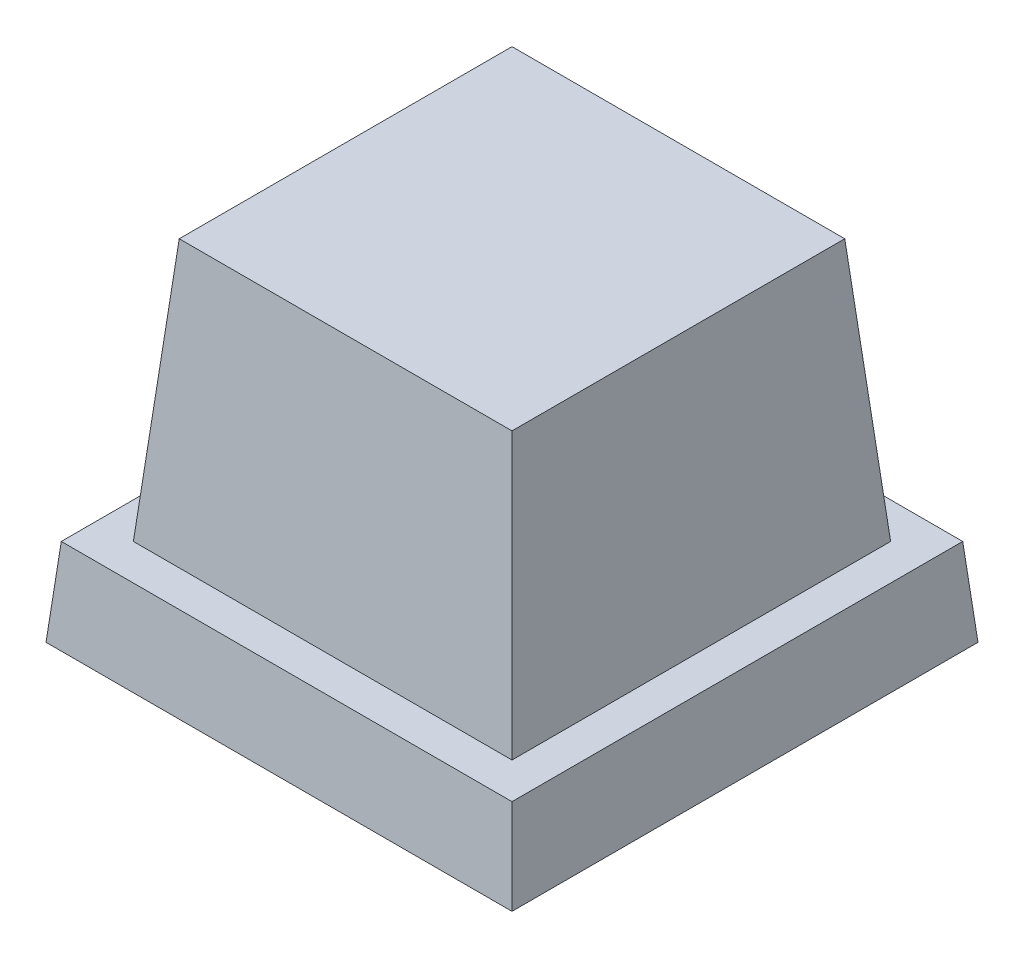
ISO-10303-21;
HEADER;
FILE_DESCRIPTION(('STEP AP214'),'2;1');
FILE_NAME('part.step','',(''),(''),'','','');
FILE_SCHEMA(('AUTOMOTIVE_DESIGN { 1 0 10303 214 1 1 1 1 }'));
ENDSEC;
DATA;
#1=APPLICATION_CONTEXT('core data for automotive mechanical design processes');
#2=APPLICATION_PROTOCOL_DEFINITION('international standard','automotive_design',2000,#1);
#3=PRODUCT_CONTEXT('',#1,'mechanical');
#4=PRODUCT('Part','Part','',(#3));
#5=PRODUCT_RELATED_PRODUCT_CATEGORY('part','',(#4));
#6=PRODUCT_DEFINITION_FORMATION('','',#4);
#7=PRODUCT_DEFINITION_CONTEXT('part definition',#1,'design');
#8=PRODUCT_DEFINITION('design','',#6,#7);
#9=PRODUCT_DEFINITION_SHAPE('','',#8);
#10=(LENGTH_UNIT() NAMED_UNIT(*) SI_UNIT(.MILLI.,.METRE.));
#11=(NAMED_UNIT(*) PLANE_ANGLE_UNIT() SI_UNIT($,.RADIAN.));
#12=(NAMED_UNIT(*) SI_UNIT($,.STERADIAN.) SOLID_ANGLE_UNIT());
#13=UNCERTAINTY_MEASURE_WITH_UNIT(LENGTH_MEASURE(1.E-05),#10,'distance_accuracy_value','');
#14=(GEOMETRIC_REPRESENTATION_CONTEXT(3) GLOBAL_UNCERTAINTY_ASSIGNED_CONTEXT((#13)) GLOBAL_UNIT_ASSIGNED_CONTEXT((#10,
#11,#12)) REPRESENTATION_CONTEXT('',''));
#15=CARTESIAN_POINT('',(0.,0.,0.));
#16=DIRECTION('',(0.,0.,1.));
#17=DIRECTION('',(1.,0.,0.));
#18=AXIS2_PLACEMENT_3D('',#15,#16,#17);
#19=CARTESIAN_POINT('',(0.,0.,0.));
#20=DIRECTION('',(0.996194698091746,0.0871557427476582,0.));
#21=DIRECTION('',(-0.0871557427476582,0.996194698091746,0.));
#22=AXIS2_PLACEMENT_3D('',#19,#20,#21);
#23=PLANE('',#22);
#24=DIRECTION('',(0.,0.,-1.));
#25=VECTOR('',#24,1.);
#26=CARTESIAN_POINT('',(0.,0.,0.));
#27=LINE('',#26,#25);
#28=CARTESIAN_POINT('',(0.,0.,0.));
#29=VERTEX_POINT('',#28);
#30=CARTESIAN_POINT('',(0.,0.,-32.));
#31=VERTEX_POINT('',#30);
#32=EDGE_CURVE('E211',#29,#31,#27,.T.);
#33=ORIENTED_EDGE('',*,*,#32,.T.);
#34=DIRECTION('',(0.0868265938642476,-0.992432509138967,-0.0868265938642477));
#35=VECTOR('',#34,1.);
#36=CARTESIAN_POINT('',(0.,0.,-32.));
#37=LINE('',#36,#35);
#38=CARTESIAN_POINT('',(-0.524931981155544,6.,-31.4750680188445));
#39=VERTEX_POINT('',#38);
#40=EDGE_CURVE('E238',#39,#31,#37,.T.);
#41=ORIENTED_EDGE('',*,*,#40,.F.);
#42=DIRECTION('',(0.,0.,1.));
#43=VECTOR('',#42,1.);
#44=CARTESIAN_POINT('',(-0.524931981155544,6.,0.));
#45=LINE('',#44,#43);
#46=CARTESIAN_POINT('',(-0.524931981155544,6.,-0.524931981155544));
#47=VERTEX_POINT('',#46);
#48=EDGE_CURVE('E237',#47,#39,#45,.F.);
#49=ORIENTED_EDGE('',*,*,#48,.F.);
#50=DIRECTION('',(0.0868265938642476,-0.992432509138967,0.0868265938642476));
#51=VECTOR('',#50,1.);
#52=CARTESIAN_POINT('',(0.,0.,0.));
#53=LINE('',#52,#51);
#54=EDGE_CURVE('E243',#47,#29,#53,.T.);
#55=ORIENTED_EDGE('',*,*,#54,.T.);
#56=EDGE_LOOP('',(#33,#41,#49,#55));
#57=FACE_BOUND('',#56,.T.);
#58=ADVANCED_FACE('F35',(#57),#23,.T.);
#59=CARTESIAN_POINT('',(0.,0.,-32.));
#60=DIRECTION('',(0.,0.0871557427476582,-0.996194698091746));
#61=DIRECTION('',(0.,0.996194698091746,0.0871557427476582));
#62=AXIS2_PLACEMENT_3D('',#59,#60,#61);
#63=PLANE('',#62);
#64=DIRECTION('',(-1.,0.,0.));
#65=VECTOR('',#64,1.);
#66=CARTESIAN_POINT('',(0.,0.,-32.));
#67=LINE('',#66,#65);
#68=CARTESIAN_POINT('',(-32.,0.,-32.));
#69=VERTEX_POINT('',#68);
#70=EDGE_CURVE('E231',#31,#69,#67,.T.);
#71=ORIENTED_EDGE('',*,*,#70,.T.);
#72=DIRECTION('',(-0.0868265938642476,-0.992432509138967,-0.0868265938642476));
#73=VECTOR('',#72,1.);
#74=CARTESIAN_POINT('',(-31.7587565631339,2.75742510107793,-31.7587565631339));
#75=LINE('',#74,#73);
#76=CARTESIAN_POINT('',(-31.4750680188445,6.,-31.4750680188445));
#77=VERTEX_POINT('',#76);
#78=EDGE_CURVE('E242',#77,#69,#75,.T.);
#79=ORIENTED_EDGE('',*,*,#78,.F.);
#80=DIRECTION('',(1.,0.,0.));
#81=VECTOR('',#80,1.);
#82=CARTESIAN_POINT('',(0.,6.,-31.4750680188445));
#83=LINE('',#82,#81);
#84=EDGE_CURVE('E254',#39,#77,#83,.F.);
#85=ORIENTED_EDGE('',*,*,#84,.F.);
#86=ORIENTED_EDGE('',*,*,#40,.T.);
#87=EDGE_LOOP('',(#71,#79,#85,#86));
#88=FACE_BOUND('',#87,.T.);
#89=ADVANCED_FACE('F302',(#88),#63,.T.);
#90=CARTESIAN_POINT('',(-32.,0.,0.));
#91=DIRECTION('',(-0.996194698091746,0.0871557427476582,0.));
#92=DIRECTION('',(-0.0871557427476582,-0.996194698091746,0.));
#93=AXIS2_PLACEMENT_3D('',#90,#91,#92);
#94=PLANE('',#93);
#95=DIRECTION('',(0.,0.,1.));
#96=VECTOR('',#95,1.);
#97=CARTESIAN_POINT('',(-32.,0.,0.));
#98=LINE('',#97,#96);
#99=CARTESIAN_POINT('',(-32.,0.,0.));
#100=VERTEX_POINT('',#99);
#101=EDGE_CURVE('E233',#69,#100,#98,.T.);
#102=ORIENTED_EDGE('',*,*,#101,.T.);
#103=DIRECTION('',(-0.0868265938642476,-0.992432509138967,0.0868265938642476));
#104=VECTOR('',#103,1.);
#105=CARTESIAN_POINT('',(-31.7587565631339,2.75742510107793,-0.241243436866144));
#106=LINE('',#105,#104);
#107=CARTESIAN_POINT('',(-31.4750680188445,6.,-0.524931981155544));
#108=VERTEX_POINT('',#107);
#109=EDGE_CURVE('E246',#108,#100,#106,.T.);
#110=ORIENTED_EDGE('',*,*,#109,.F.);
#111=DIRECTION('',(0.,0.,-1.));
#112=VECTOR('',#111,1.);
#113=CARTESIAN_POINT('',(-31.4750680188445,6.,0.));
#114=LINE('',#113,#112);
#115=EDGE_CURVE('E256',#77,#108,#114,.F.);
#116=ORIENTED_EDGE('',*,*,#115,.F.);
#117=ORIENTED_EDGE('',*,*,#78,.T.);
#118=EDGE_LOOP('',(#102,#110,#116,#117));
#119=FACE_BOUND('',#118,.T.);
#120=ADVANCED_FACE('F308',(#119),#94,.T.);
#121=CARTESIAN_POINT('',(0.,0.,0.));
#122=DIRECTION('',(0.,0.0871557427476582,0.996194698091746));
#123=DIRECTION('',(0.,-0.996194698091746,0.0871557427476582));
#124=AXIS2_PLACEMENT_3D('',#121,#122,#123);
#125=PLANE('',#124);
#126=DIRECTION('',(1.,0.,0.));
#127=VECTOR('',#126,1.);
#128=CARTESIAN_POINT('',(0.,0.,0.));
#129=LINE('',#128,#127);
#130=EDGE_CURVE('E235',#100,#29,#129,.T.);
#131=ORIENTED_EDGE('',*,*,#130,.T.);
#132=ORIENTED_EDGE('',*,*,#54,.F.);
#133=DIRECTION('',(-1.,0.,0.));
#134=VECTOR('',#133,1.);
#135=CARTESIAN_POINT('',(0.,6.,-0.524931981155544));
#136=LINE('',#135,#134);
#137=EDGE_CURVE('E247',#108,#47,#136,.F.);
#138=ORIENTED_EDGE('',*,*,#137,.F.);
#139=ORIENTED_EDGE('',*,*,#109,.T.);
#140=EDGE_LOOP('',(#131,#132,#138,#139));
#141=FACE_BOUND('',#140,.T.);
#142=ADVANCED_FACE('F315',(#141),#125,.T.);
#143=CARTESIAN_POINT('',(0.,6.,0.));
#144=DIRECTION('',(0.,1.,0.));
#145=DIRECTION('',(0.,0.,1.));
#146=AXIS2_PLACEMENT_3D('',#143,#144,#145);
#147=PLANE('',#146);
#148=DIRECTION('',(0.,0.,1.));
#149=VECTOR('',#148,1.);
#150=CARTESIAN_POINT('',(-29.,6.,-29.));
#151=LINE('',#150,#149);
#152=CARTESIAN_POINT('',(-29.,6.,-29.));
#153=VERTEX_POINT('',#152);
#154=CARTESIAN_POINT('',(-29.,6.,-3.00000000000001));
#155=VERTEX_POINT('',#154);
#156=EDGE_CURVE('E194',#153,#155,#151,.T.);
#157=ORIENTED_EDGE('',*,*,#156,.F.);
#158=DIRECTION('',(-1.,0.,0.));
#159=VECTOR('',#158,1.);
#160=CARTESIAN_POINT('',(-29.,6.,-29.));
#161=LINE('',#160,#159);
#162=CARTESIAN_POINT('',(-3.,6.,-29.));
#163=VERTEX_POINT('',#162);
#164=EDGE_CURVE('E204',#163,#153,#161,.T.);
#165=ORIENTED_EDGE('',*,*,#164,.F.);
#166=DIRECTION('',(0.,0.,-1.));
#167=VECTOR('',#166,1.);
#168=CARTESIAN_POINT('',(-3.,6.,-29.));
#169=LINE('',#168,#167);
#170=CARTESIAN_POINT('',(-3.,6.,-3.00000000000001));
#171=VERTEX_POINT('',#170);
#172=EDGE_CURVE('E201',#171,#163,#169,.T.);
#173=ORIENTED_EDGE('',*,*,#172,.F.);
#174=DIRECTION('',(1.,0.,0.));
#175=VECTOR('',#174,1.);
#176=CARTESIAN_POINT('',(-29.,6.,-3.00000000000001));
#177=LINE('',#176,#175);
#178=EDGE_CURVE('E197',#155,#171,#177,.T.);
#179=ORIENTED_EDGE('',*,*,#178,.F.);
#180=EDGE_LOOP('',(#157,#165,#173,#179));
#181=FACE_BOUND('',#180,.T.);
#182=ORIENTED_EDGE('',*,*,#48,.T.);
#183=ORIENTED_EDGE('',*,*,#84,.T.);
#184=ORIENTED_EDGE('',*,*,#115,.T.);
#185=ORIENTED_EDGE('',*,*,#137,.T.);
#186=EDGE_LOOP('',(#182,#183,#184,#185));
#187=FACE_BOUND('',#186,.T.);
#188=ADVANCED_FACE('F318',(#181,#187),#147,.T.);
#189=CARTESIAN_POINT('',(0.,0.,0.));
#190=DIRECTION('',(0.,1.,0.));
#191=DIRECTION('',(0.,0.,1.));
#192=AXIS2_PLACEMENT_3D('',#189,#190,#191);
#193=PLANE('',#192);
#194=DIRECTION('',(-1.,0.,0.));
#195=VECTOR('',#194,1.);
#196=CARTESIAN_POINT('',(0.,0.,-0.803055870034678));
#197=LINE('',#196,#195);
#198=CARTESIAN_POINT('',(-31.1969441299653,0.,-0.803055870034678));
#199=VERTEX_POINT('',#198);
#200=CARTESIAN_POINT('',(-0.803055870034678,0.,-0.803055870034678));
#201=VERTEX_POINT('',#200);
#202=EDGE_CURVE('E185',#199,#201,#197,.F.);
#203=ORIENTED_EDGE('',*,*,#202,.T.);
#204=DIRECTION('',(0.,0.,1.));
#205=VECTOR('',#204,1.);
#206=CARTESIAN_POINT('',(-0.803055870034678,0.,0.));
#207=LINE('',#206,#205);
#208=CARTESIAN_POINT('',(-0.803055870034678,0.,-31.1969441299653));
#209=VERTEX_POINT('',#208);
#210=EDGE_CURVE('E170',#201,#209,#207,.F.);
#211=ORIENTED_EDGE('',*,*,#210,.T.);
#212=DIRECTION('',(1.,0.,0.));
#213=VECTOR('',#212,1.);
#214=CARTESIAN_POINT('',(0.,0.,-31.1969441299653));
#215=LINE('',#214,#213);
#216=CARTESIAN_POINT('',(-31.1969441299653,0.,-31.1969441299653));
#217=VERTEX_POINT('',#216);
#218=EDGE_CURVE('E173',#209,#217,#215,.F.);
#219=ORIENTED_EDGE('',*,*,#218,.T.);
#220=DIRECTION('',(0.,0.,-1.));
#221=VECTOR('',#220,1.);
#222=CARTESIAN_POINT('',(-31.1969441299653,0.,0.));
#223=LINE('',#222,#221);
#224=EDGE_CURVE('E189',#217,#199,#223,.F.);
#225=ORIENTED_EDGE('',*,*,#224,.T.);
#226=EDGE_LOOP('',(#203,#211,#219,#225));
#227=FACE_BOUND('',#226,.T.);
#228=ORIENTED_EDGE('',*,*,#32,.F.);
#229=ORIENTED_EDGE('',*,*,#130,.F.);
#230=ORIENTED_EDGE('',*,*,#101,.F.);
#231=ORIENTED_EDGE('',*,*,#70,.F.);
#232=EDGE_LOOP('',(#228,#229,#230,#231));
#233=FACE_BOUND('',#232,.T.);
#234=ADVANCED_FACE('F313',(#227,#233),#193,.F.);
#235=CARTESIAN_POINT('',(-29.,6.,-29.));
#236=DIRECTION('',(-0.996194698091746,0.0871557427476582,0.));
#237=DIRECTION('',(-0.0871557427476582,-0.996194698091746,0.));
#238=AXIS2_PLACEMENT_3D('',#235,#236,#237);
#239=PLANE('',#238);
#240=ORIENTED_EDGE('',*,*,#156,.T.);
#241=DIRECTION('',(-0.0868265938642476,-0.992432509138967,0.0868265938642476));
#242=VECTOR('',#241,1.);
#243=CARTESIAN_POINT('',(-29.,6.,-3.00000000000001));
#244=LINE('',#243,#242);
#245=CARTESIAN_POINT('',(-27.4252040565334,24.,-4.57479594346664));
#246=VERTEX_POINT('',#245);
#247=EDGE_CURVE('E208',#246,#155,#244,.T.);
#248=ORIENTED_EDGE('',*,*,#247,.F.);
#249=DIRECTION('',(0.,0.,-1.));
#250=VECTOR('',#249,1.);
#251=CARTESIAN_POINT('',(-27.4252040565334,24.,-29.));
#252=LINE('',#251,#250);
#253=CARTESIAN_POINT('',(-27.4252040565334,24.,-27.4252040565334));
#254=VERTEX_POINT('',#253);
#255=EDGE_CURVE('E207',#254,#246,#252,.F.);
#256=ORIENTED_EDGE('',*,*,#255,.F.);
#257=DIRECTION('',(-0.0868265938642476,-0.992432509138967,-0.0868265938642476));
#258=VECTOR('',#257,1.);
#259=CARTESIAN_POINT('',(-29.,6.,-29.));
#260=LINE('',#259,#258);
#261=EDGE_CURVE('E213',#254,#153,#260,.T.);
#262=ORIENTED_EDGE('',*,*,#261,.T.);
#263=EDGE_LOOP('',(#240,#248,#256,#262));
#264=FACE_BOUND('',#263,.T.);
#265=ADVANCED_FACE('F441',(#264),#239,.T.);
#266=CARTESIAN_POINT('',(-29.,6.,-3.00000000000001));
#267=DIRECTION('',(0.,0.0871557427476582,0.996194698091746));
#268=DIRECTION('',(0.,-0.996194698091746,0.0871557427476582));
#269=AXIS2_PLACEMENT_3D('',#266,#267,#268);
#270=PLANE('',#269);
#271=ORIENTED_EDGE('',*,*,#178,.T.);
#272=DIRECTION('',(0.0868265938642476,-0.992432509138967,0.0868265938642476));
#273=VECTOR('',#272,1.);
#274=CARTESIAN_POINT('',(-3.19601029245374,8.24040789462582,-3.19601029245375));
#275=LINE('',#274,#273);
#276=CARTESIAN_POINT('',(-4.57479594346664,24.,-4.57479594346664));
#277=VERTEX_POINT('',#276);
#278=EDGE_CURVE('E212',#277,#171,#275,.T.);
#279=ORIENTED_EDGE('',*,*,#278,.F.);
#280=DIRECTION('',(-1.,0.,0.));
#281=VECTOR('',#280,1.);
#282=CARTESIAN_POINT('',(-29.,24.,-4.57479594346664));
#283=LINE('',#282,#281);
#284=EDGE_CURVE('E224',#246,#277,#283,.F.);
#285=ORIENTED_EDGE('',*,*,#284,.F.);
#286=ORIENTED_EDGE('',*,*,#247,.T.);
#287=EDGE_LOOP('',(#271,#279,#285,#286));
#288=FACE_BOUND('',#287,.T.);
#289=ADVANCED_FACE('F458',(#288),#270,.T.);
#290=CARTESIAN_POINT('',(-3.,6.,-29.));
#291=DIRECTION('',(0.996194698091745,0.0871557427476582,0.));
#292=DIRECTION('',(-0.0871557427476582,0.996194698091746,0.));
#293=AXIS2_PLACEMENT_3D('',#290,#291,#292);
#294=PLANE('',#293);
#295=ORIENTED_EDGE('',*,*,#172,.T.);
#296=DIRECTION('',(0.0868265938642476,-0.992432509138967,-0.0868265938642476));
#297=VECTOR('',#296,1.);
#298=CARTESIAN_POINT('',(-3.19601029245374,8.24040789462582,-28.8039897075463));
#299=LINE('',#298,#297);
#300=CARTESIAN_POINT('',(-4.57479594346664,24.,-27.4252040565334));
#301=VERTEX_POINT('',#300);
#302=EDGE_CURVE('E216',#301,#163,#299,.T.);
#303=ORIENTED_EDGE('',*,*,#302,.F.);
#304=DIRECTION('',(0.,0.,1.));
#305=VECTOR('',#304,1.);
#306=CARTESIAN_POINT('',(-4.57479594346664,24.,-29.));
#307=LINE('',#306,#305);
#308=EDGE_CURVE('E226',#277,#301,#307,.F.);
#309=ORIENTED_EDGE('',*,*,#308,.F.);
#310=ORIENTED_EDGE('',*,*,#278,.T.);
#311=EDGE_LOOP('',(#295,#303,#309,#310));
#312=FACE_BOUND('',#311,.T.);
#313=ADVANCED_FACE('F461',(#312),#294,.T.);
#314=CARTESIAN_POINT('',(-29.,6.,-29.));
#315=DIRECTION('',(0.,0.0871557427476582,-0.996194698091745));
#316=DIRECTION('',(0.,0.996194698091746,0.0871557427476582));
#317=AXIS2_PLACEMENT_3D('',#314,#315,#316);
#318=PLANE('',#317);
#319=ORIENTED_EDGE('',*,*,#164,.T.);
#320=ORIENTED_EDGE('',*,*,#261,.F.);
#321=DIRECTION('',(1.,0.,0.));
#322=VECTOR('',#321,1.);
#323=CARTESIAN_POINT('',(-29.,24.,-27.4252040565334));
#324=LINE('',#323,#322);
#325=EDGE_CURVE('E217',#301,#254,#324,.F.);
#326=ORIENTED_EDGE('',*,*,#325,.F.);
#327=ORIENTED_EDGE('',*,*,#302,.T.);
#328=EDGE_LOOP('',(#319,#320,#326,#327));
#329=FACE_BOUND('',#328,.T.);
#330=ADVANCED_FACE('F465',(#329),#318,.T.);
#331=CARTESIAN_POINT('',(0.,24.,0.));
#332=DIRECTION('',(0.,1.,0.));
#333=DIRECTION('',(0.,0.,1.));
#334=AXIS2_PLACEMENT_3D('',#331,#332,#333);
#335=PLANE('',#334);
#336=ORIENTED_EDGE('',*,*,#255,.T.);
#337=ORIENTED_EDGE('',*,*,#284,.T.);
#338=ORIENTED_EDGE('',*,*,#308,.T.);
#339=ORIENTED_EDGE('',*,*,#325,.T.);
#340=EDGE_LOOP('',(#336,#337,#338,#339));
#341=FACE_BOUND('',#340,.T.);
#342=ADVANCED_FACE('F365',(#341),#335,.T.);
#343=CARTESIAN_POINT('',(-0.796955758473397,-0.0697245941981266,0.));
#344=DIRECTION('',(0.996194698091746,0.0871557427476582,0.));
#345=DIRECTION('',(-0.0871557427476582,0.996194698091746,0.));
#346=AXIS2_PLACEMENT_3D('',#343,#344,#345);
#347=PLANE('',#346);
#348=DIRECTION('',(0.0868265938642476,-0.992432509138967,0.0868265938642476));
#349=VECTOR('',#348,1.);
#350=CARTESIAN_POINT('',(-0.790947622654509,-0.1383979008501,-0.790947622654509));
#351=LINE('',#350,#349);
#352=CARTESIAN_POINT('',(-1.01830492962672,2.46030800925719,-1.01830492962672));
#353=VERTEX_POINT('',#352);
#354=EDGE_CURVE('E188',#353,#201,#351,.T.);
#355=ORIENTED_EDGE('',*,*,#354,.F.);
#356=DIRECTION('',(0.,0.,1.));
#357=VECTOR('',#356,1.);
#358=CARTESIAN_POINT('',(-1.01830492962672,2.46030800925719,0.));
#359=LINE('',#358,#357);
#360=CARTESIAN_POINT('',(-1.01830492962672,2.46030800925719,-30.9816950703733));
#361=VERTEX_POINT('',#360);
#362=EDGE_CURVE('E265',#353,#361,#359,.F.);
#363=ORIENTED_EDGE('',*,*,#362,.T.);
#364=DIRECTION('',(0.0868265938642476,-0.992432509138967,-0.0868265938642477));
#365=VECTOR('',#364,1.);
#366=CARTESIAN_POINT('',(-0.790947622654509,-0.1383979008501,-31.2090523773455));
#367=LINE('',#366,#365);
#368=EDGE_CURVE('E198',#361,#209,#367,.T.);
#369=ORIENTED_EDGE('',*,*,#368,.T.);
#370=ORIENTED_EDGE('',*,*,#210,.F.);
#371=EDGE_LOOP('',(#355,#363,#369,#370));
#372=FACE_BOUND('',#371,.T.);
#373=ADVANCED_FACE('F359',(#372),#347,.F.);
#374=CARTESIAN_POINT('',(0.,-0.0697245941981266,-31.2030442415266));
#375=DIRECTION('',(0.,0.0871557427476582,-0.996194698091746));
#376=DIRECTION('',(0.,0.996194698091746,0.0871557427476582));
#377=AXIS2_PLACEMENT_3D('',#374,#375,#376);
#378=PLANE('',#377);
#379=ORIENTED_EDGE('',*,*,#368,.F.);
#380=DIRECTION('',(1.,0.,0.));
#381=VECTOR('',#380,1.);
#382=CARTESIAN_POINT('',(0.,2.46030800925719,-30.9816950703733));
#383=LINE('',#382,#381);
#384=CARTESIAN_POINT('',(-30.9816950703733,2.46030800925719,-30.9816950703733));
#385=VERTEX_POINT('',#384);
#386=EDGE_CURVE('E263',#361,#385,#383,.F.);
#387=ORIENTED_EDGE('',*,*,#386,.T.);
#388=DIRECTION('',(-0.0868265938642476,-0.992432509138967,-0.0868265938642476));
#389=VECTOR('',#388,1.);
#390=CARTESIAN_POINT('',(-30.9678089404793,2.61902720022783,-30.9678089404794));
#391=LINE('',#390,#389);
#392=EDGE_CURVE('E431',#385,#217,#391,.T.);
#393=ORIENTED_EDGE('',*,*,#392,.T.);
#394=ORIENTED_EDGE('',*,*,#218,.F.);
#395=EDGE_LOOP('',(#379,#387,#393,#394));
#396=FACE_BOUND('',#395,.T.);
#397=ADVANCED_FACE('F364',(#396),#378,.F.);
#398=CARTESIAN_POINT('',(-31.2030442415266,-0.0697245941981266,0.));
#399=DIRECTION('',(-0.996194698091746,0.0871557427476582,0.));
#400=DIRECTION('',(-0.0871557427476582,-0.996194698091746,0.));
#401=AXIS2_PLACEMENT_3D('',#398,#399,#400);
#402=PLANE('',#401);
#403=ORIENTED_EDGE('',*,*,#392,.F.);
#404=DIRECTION('',(0.,0.,-1.));
#405=VECTOR('',#404,1.);
#406=CARTESIAN_POINT('',(-30.9816950703733,2.46030800925719,0.));
#407=LINE('',#406,#405);
#408=CARTESIAN_POINT('',(-30.9816950703733,2.46030800925719,-1.01830492962672));
#409=VERTEX_POINT('',#408);
#410=EDGE_CURVE('E261',#385,#409,#407,.F.);
#411=ORIENTED_EDGE('',*,*,#410,.T.);
#412=DIRECTION('',(-0.0868265938642476,-0.992432509138967,0.0868265938642476));
#413=VECTOR('',#412,1.);
#414=CARTESIAN_POINT('',(-30.9678089404794,2.61902720022783,-1.03219105952065));
#415=LINE('',#414,#413);
#416=EDGE_CURVE('E177',#409,#199,#415,.T.);
#417=ORIENTED_EDGE('',*,*,#416,.T.);
#418=ORIENTED_EDGE('',*,*,#224,.F.);
#419=EDGE_LOOP('',(#403,#411,#417,#418));
#420=FACE_BOUND('',#419,.T.);
#421=ADVANCED_FACE('F377',(#420),#402,.F.);
#422=CARTESIAN_POINT('',(0.,-0.0697245941981266,-0.796955758473397));
#423=DIRECTION('',(0.,0.0871557427476582,0.996194698091746));
#424=DIRECTION('',(0.,-0.996194698091746,0.0871557427476582));
#425=AXIS2_PLACEMENT_3D('',#422,#423,#424);
#426=PLANE('',#425);
#427=ORIENTED_EDGE('',*,*,#416,.F.);
#428=DIRECTION('',(-1.,0.,0.));
#429=VECTOR('',#428,1.);
#430=CARTESIAN_POINT('',(0.,2.46030800925719,-1.01830492962672));
#431=LINE('',#430,#429);
#432=EDGE_CURVE('E241',#409,#353,#431,.F.);
#433=ORIENTED_EDGE('',*,*,#432,.T.);
#434=ORIENTED_EDGE('',*,*,#354,.T.);
#435=ORIENTED_EDGE('',*,*,#202,.F.);
#436=EDGE_LOOP('',(#427,#433,#434,#435));
#437=FACE_BOUND('',#436,.T.);
#438=ADVANCED_FACE('F387',(#437),#426,.F.);
#439=CARTESIAN_POINT('',(-28.2030442415266,5.93027540580187,-29.));
#440=DIRECTION('',(-0.996194698091746,0.0871557427476582,0.));
#441=DIRECTION('',(-0.0871557427476582,-0.996194698091746,0.));
#442=AXIS2_PLACEMENT_3D('',#439,#440,#441);
#443=PLANE('',#442);
#444=DIRECTION('',(0.,0.,-1.));
#445=VECTOR('',#444,1.);
#446=CARTESIAN_POINT('',(-28.2693254592646,5.1726776203659,0.));
#447=LINE('',#446,#445);
#448=CARTESIAN_POINT('',(-28.2693254592646,5.1726776203659,-3.73067454073541));
#449=VERTEX_POINT('',#448);
#450=CARTESIAN_POINT('',(-28.2693254592646,5.1726776203659,-28.2693254592646));
#451=VERTEX_POINT('',#450);
#452=EDGE_CURVE('E268',#449,#451,#447,.T.);
#453=ORIENTED_EDGE('',*,*,#452,.T.);
#454=DIRECTION('',(-0.0868265938642476,-0.992432509138967,-0.0868265938642476));
#455=VECTOR('',#454,1.);
#456=CARTESIAN_POINT('',(-28.2090523773455,5.8616020991499,-28.2090523773455));
#457=LINE('',#456,#455);
#458=CARTESIAN_POINT('',(-26.6921391173194,23.2,-26.6921391173194));
#459=VERTEX_POINT('',#458);
#460=EDGE_CURVE('E165',#459,#451,#457,.T.);
#461=ORIENTED_EDGE('',*,*,#460,.F.);
#462=DIRECTION('',(0.,0.,-1.));
#463=VECTOR('',#462,1.);
#464=CARTESIAN_POINT('',(-26.6921391173194,23.2,-29.));
#465=LINE('',#464,#463);
#466=CARTESIAN_POINT('',(-26.6921391173194,23.2,-5.30786088268058));
#467=VERTEX_POINT('',#466);
#468=EDGE_CURVE('E155',#459,#467,#465,.F.);
#469=ORIENTED_EDGE('',*,*,#468,.T.);
#470=DIRECTION('',(-0.0868265938642476,-0.992432509138967,0.0868265938642476));
#471=VECTOR('',#470,1.);
#472=CARTESIAN_POINT('',(-28.2090523773455,5.8616020991499,-3.79094762265451));
#473=LINE('',#472,#471);
#474=EDGE_CURVE('E163',#467,#449,#473,.T.);
#475=ORIENTED_EDGE('',*,*,#474,.T.);
#476=EDGE_LOOP('',(#453,#461,#469,#475));
#477=FACE_BOUND('',#476,.T.);
#478=ADVANCED_FACE('F162',(#477),#443,.F.);
#479=CARTESIAN_POINT('',(-29.,5.93027540580187,-3.7969557584734));
#480=DIRECTION('',(0.,0.0871557427476582,0.996194698091746));
#481=DIRECTION('',(0.,-0.996194698091746,0.0871557427476582));
#482=AXIS2_PLACEMENT_3D('',#479,#480,#481);
#483=PLANE('',#482);
#484=DIRECTION('',(0.0868265938642476,-0.992432509138967,0.0868265938642476));
#485=VECTOR('',#484,1.);
#486=CARTESIAN_POINT('',(-3.98695791510825,8.10200999377572,-3.98695791510825));
#487=LINE('',#486,#485);
#488=CARTESIAN_POINT('',(-5.30786088268057,23.2,-5.30786088268058));
#489=VERTEX_POINT('',#488);
#490=CARTESIAN_POINT('',(-3.73067454073541,5.17267762036591,-3.73067454073541));
#491=VERTEX_POINT('',#490);
#492=EDGE_CURVE('E53',#489,#491,#487,.T.);
#493=ORIENTED_EDGE('',*,*,#492,.T.);
#494=DIRECTION('',(-1.,0.,0.));
#495=VECTOR('',#494,1.);
#496=CARTESIAN_POINT('',(0.,5.17267762036591,-3.73067454073541));
#497=LINE('',#496,#495);
#498=EDGE_CURVE('E169',#491,#449,#497,.T.);
#499=ORIENTED_EDGE('',*,*,#498,.T.);
#500=ORIENTED_EDGE('',*,*,#474,.F.);
#501=DIRECTION('',(-1.,0.,0.));
#502=VECTOR('',#501,1.);
#503=CARTESIAN_POINT('',(-29.,23.2,-5.30786088268058));
#504=LINE('',#503,#502);
#505=EDGE_CURVE('E151',#467,#489,#504,.F.);
#506=ORIENTED_EDGE('',*,*,#505,.T.);
#507=EDGE_LOOP('',(#493,#499,#500,#506));
#508=FACE_BOUND('',#507,.T.);
#509=ADVANCED_FACE('F167',(#508),#483,.F.);
#510=CARTESIAN_POINT('',(-3.7969557584734,5.93027540580187,-29.));
#511=DIRECTION('',(0.996194698091745,0.0871557427476582,0.));
#512=DIRECTION('',(-0.0871557427476582,0.996194698091746,0.));
#513=AXIS2_PLACEMENT_3D('',#510,#511,#512);
#514=PLANE('',#513);
#515=DIRECTION('',(0.0868265938642476,-0.992432509138967,-0.0868265938642476));
#516=VECTOR('',#515,1.);
#517=CARTESIAN_POINT('',(-3.98695791510825,8.10200999377572,-28.0130420848918));
#518=LINE('',#517,#516);
#519=CARTESIAN_POINT('',(-5.30786088268058,23.2,-26.6921391173194));
#520=VERTEX_POINT('',#519);
#521=CARTESIAN_POINT('',(-3.73067454073541,5.1726776203659,-28.2693254592646));
#522=VERTEX_POINT('',#521);
#523=EDGE_CURVE('E59',#520,#522,#518,.T.);
#524=ORIENTED_EDGE('',*,*,#523,.T.);
#525=DIRECTION('',(0.,0.,1.));
#526=VECTOR('',#525,1.);
#527=CARTESIAN_POINT('',(-3.7306745407354,5.1726776203659,0.));
#528=LINE('',#527,#526);
#529=EDGE_CURVE('E11',#522,#491,#528,.T.);
#530=ORIENTED_EDGE('',*,*,#529,.T.);
#531=ORIENTED_EDGE('',*,*,#492,.F.);
#532=DIRECTION('',(0.,0.,1.));
#533=VECTOR('',#532,1.);
#534=CARTESIAN_POINT('',(-5.30786088268058,23.2,-29.));
#535=LINE('',#534,#533);
#536=EDGE_CURVE('E156',#489,#520,#535,.F.);
#537=ORIENTED_EDGE('',*,*,#536,.T.);
#538=EDGE_LOOP('',(#524,#530,#531,#537));
#539=FACE_BOUND('',#538,.T.);
#540=ADVANCED_FACE('F293',(#539),#514,.F.);
#541=CARTESIAN_POINT('',(-29.,5.93027540580187,-28.2030442415266));
#542=DIRECTION('',(0.,0.0871557427476582,-0.996194698091745));
#543=DIRECTION('',(0.,0.996194698091746,0.0871557427476582));
#544=AXIS2_PLACEMENT_3D('',#541,#542,#543);
#545=PLANE('',#544);
#546=DIRECTION('',(1.,0.,0.));
#547=VECTOR('',#546,1.);
#548=CARTESIAN_POINT('',(0.,5.1726776203659,-28.2693254592646));
#549=LINE('',#548,#547);
#550=EDGE_CURVE('E45',#451,#522,#549,.T.);
#551=ORIENTED_EDGE('',*,*,#550,.T.);
#552=ORIENTED_EDGE('',*,*,#523,.F.);
#553=DIRECTION('',(1.,0.,0.));
#554=VECTOR('',#553,1.);
#555=CARTESIAN_POINT('',(-29.,23.2,-26.6921391173194));
#556=LINE('',#555,#554);
#557=EDGE_CURVE('E180',#520,#459,#556,.F.);
#558=ORIENTED_EDGE('',*,*,#557,.T.);
#559=ORIENTED_EDGE('',*,*,#460,.T.);
#560=EDGE_LOOP('',(#551,#552,#558,#559));
#561=FACE_BOUND('',#560,.T.);
#562=ADVANCED_FACE('F291',(#561),#545,.F.);
#563=CARTESIAN_POINT('',(0.,23.2,0.));
#564=DIRECTION('',(0.,1.,0.));
#565=DIRECTION('',(0.,0.,1.));
#566=AXIS2_PLACEMENT_3D('',#563,#564,#565);
#567=PLANE('',#566);
#568=ORIENTED_EDGE('',*,*,#468,.F.);
#569=ORIENTED_EDGE('',*,*,#557,.F.);
#570=ORIENTED_EDGE('',*,*,#536,.F.);
#571=ORIENTED_EDGE('',*,*,#505,.F.);
#572=EDGE_LOOP('',(#568,#569,#570,#571));
#573=FACE_BOUND('',#572,.T.);
#574=ADVANCED_FACE('F153',(#573),#567,.F.);
#575=CARTESIAN_POINT('',(0.,2.46030800925719,-30.9816950703733));
#576=DIRECTION('',(0.,-0.707106781186544,0.707106781186551));
#577=DIRECTION('',(1.,0.,0.));
#578=AXIS2_PLACEMENT_3D('',#575,#576,#577);
#579=PLANE('',#578);
#580=DIRECTION('',(0.577350269189624,-0.577350269189629,-0.577350269189624));
#581=VECTOR('',#580,1.);
#582=CARTESIAN_POINT('',(-0.67886995308448,2.12087303271495,-31.3211300469155));
#583=LINE('',#582,#581);
#584=EDGE_CURVE('E274',#522,#361,#583,.T.);
#585=ORIENTED_EDGE('',*,*,#584,.F.);
#586=ORIENTED_EDGE('',*,*,#550,.F.);
#587=DIRECTION('',(-0.577350269189624,-0.577350269189629,-0.577350269189624));
#588=VECTOR('',#587,1.);
#589=CARTESIAN_POINT('',(-20.6544633802489,12.7875396993816,-20.6544633802489));
#590=LINE('',#589,#588);
#591=EDGE_CURVE('E40',#385,#451,#590,.F.);
#592=ORIENTED_EDGE('',*,*,#591,.F.);
#593=ORIENTED_EDGE('',*,*,#386,.F.);
#594=EDGE_LOOP('',(#585,#586,#592,#593));
#595=FACE_BOUND('',#594,.T.);
#596=ADVANCED_FACE('F38',(#595),#579,.T.);
#597=CARTESIAN_POINT('',(-30.9816950703733,2.46030800925719,0.));
#598=DIRECTION('',(0.707106781186551,-0.707106781186544,0.));
#599=DIRECTION('',(0.,0.,-1.));
#600=AXIS2_PLACEMENT_3D('',#597,#598,#599);
#601=PLANE('',#600);
#602=ORIENTED_EDGE('',*,*,#591,.T.);
#603=ORIENTED_EDGE('',*,*,#452,.F.);
#604=DIRECTION('',(-0.577350269189624,-0.57735026918963,0.577350269189624));
#605=VECTOR('',#604,1.);
#606=CARTESIAN_POINT('',(-20.6544633802489,12.7875396993817,-11.3455366197511));
#607=LINE('',#606,#605);
#608=EDGE_CURVE('E273',#409,#449,#607,.F.);
#609=ORIENTED_EDGE('',*,*,#608,.F.);
#610=ORIENTED_EDGE('',*,*,#410,.F.);
#611=EDGE_LOOP('',(#602,#603,#609,#610));
#612=FACE_BOUND('',#611,.T.);
#613=ADVANCED_FACE('F285',(#612),#601,.T.);
#614=CARTESIAN_POINT('',(-1.01830492962672,2.46030800925719,0.));
#615=DIRECTION('',(-0.707106781186551,-0.707106781186544,0.));
#616=DIRECTION('',(0.,0.,1.));
#617=AXIS2_PLACEMENT_3D('',#614,#615,#616);
#618=PLANE('',#617);
#619=ORIENTED_EDGE('',*,*,#584,.T.);
#620=ORIENTED_EDGE('',*,*,#362,.F.);
#621=DIRECTION('',(-0.577350269189624,0.57735026918963,-0.577350269189624));
#622=VECTOR('',#621,1.);
#623=CARTESIAN_POINT('',(-0.67886995308448,2.12087303271495,-0.67886995308448));
#624=LINE('',#623,#622);
#625=EDGE_CURVE('E271',#491,#353,#624,.F.);
#626=ORIENTED_EDGE('',*,*,#625,.F.);
#627=ORIENTED_EDGE('',*,*,#529,.F.);
#628=EDGE_LOOP('',(#619,#620,#626,#627));
#629=FACE_BOUND('',#628,.T.);
#630=ADVANCED_FACE('F330',(#629),#618,.T.);
#631=CARTESIAN_POINT('',(0.,2.46030800925719,-1.01830492962672));
#632=DIRECTION('',(0.,-0.707106781186544,-0.707106781186551));
#633=DIRECTION('',(-1.,0.,0.));
#634=AXIS2_PLACEMENT_3D('',#631,#632,#633);
#635=PLANE('',#634);
#636=ORIENTED_EDGE('',*,*,#608,.T.);
#637=ORIENTED_EDGE('',*,*,#498,.F.);
#638=ORIENTED_EDGE('',*,*,#625,.T.);
#639=ORIENTED_EDGE('',*,*,#432,.F.);
#640=EDGE_LOOP('',(#636,#637,#638,#639));
#641=FACE_BOUND('',#640,.T.);
#642=ADVANCED_FACE('F324',(#641),#635,.T.);
#643=CLOSED_SHELL('',(#58,#89,#120,#142,#188,#234,#265,#289,#313,#330,#342,#373,#397,#421,#438,
#478,#509,#540,#562,#574,#596,#613,#630,#642));
#644=MANIFOLD_SOLID_BREP('B2',#643);
#645=ADVANCED_BREP_SHAPE_REPRESENTATION('',(#18,#644),#14);
#646=SHAPE_DEFINITION_REPRESENTATION(#9,#645);
ENDSEC;
END-ISO-10303-21;
